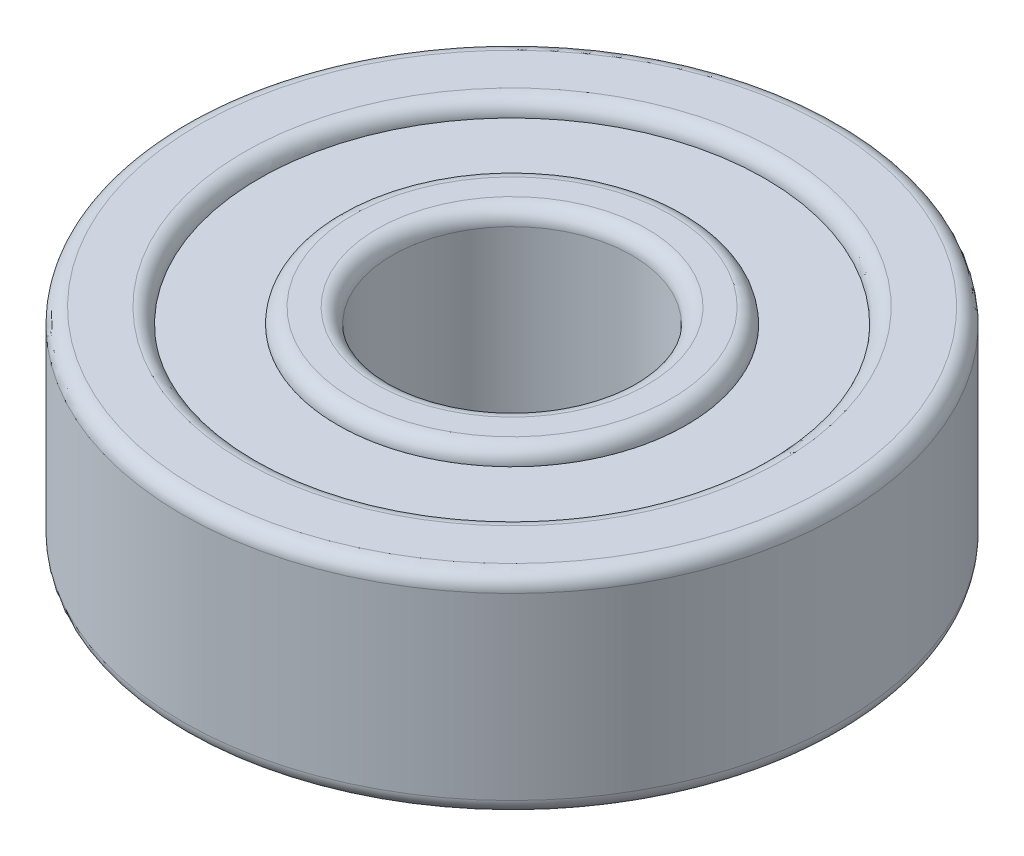
ISO-10303-21;
HEADER;
FILE_DESCRIPTION(('STEP AP214'),'2;1');
FILE_NAME('part.step','',(''),(''),'','','');
FILE_SCHEMA(('AUTOMOTIVE_DESIGN { 1 0 10303 214 1 1 1 1 }'));
ENDSEC;
DATA;
#1=APPLICATION_CONTEXT('core data for automotive mechanical design processes');
#2=APPLICATION_PROTOCOL_DEFINITION('international standard','automotive_design',2000,#1);
#3=PRODUCT_CONTEXT('',#1,'mechanical');
#4=PRODUCT('Part','Part','',(#3));
#5=PRODUCT_RELATED_PRODUCT_CATEGORY('part','',(#4));
#6=PRODUCT_DEFINITION_FORMATION('','',#4);
#7=PRODUCT_DEFINITION_CONTEXT('part definition',#1,'design');
#8=PRODUCT_DEFINITION('design','',#6,#7);
#9=PRODUCT_DEFINITION_SHAPE('','',#8);
#10=(LENGTH_UNIT() NAMED_UNIT(*) SI_UNIT(.MILLI.,.METRE.));
#11=(NAMED_UNIT(*) PLANE_ANGLE_UNIT() SI_UNIT($,.RADIAN.));
#12=(NAMED_UNIT(*) SI_UNIT($,.STERADIAN.) SOLID_ANGLE_UNIT());
#13=UNCERTAINTY_MEASURE_WITH_UNIT(LENGTH_MEASURE(1.E-05),#10,'distance_accuracy_value','');
#14=(GEOMETRIC_REPRESENTATION_CONTEXT(3) GLOBAL_UNCERTAINTY_ASSIGNED_CONTEXT((#13)) GLOBAL_UNIT_ASSIGNED_CONTEXT((#10,
#11,#12)) REPRESENTATION_CONTEXT('',''));
#15=CARTESIAN_POINT('',(0.,0.,0.));
#16=DIRECTION('',(0.,0.,1.));
#17=DIRECTION('',(1.,0.,0.));
#18=AXIS2_PLACEMENT_3D('',#15,#16,#17);
#19=CARTESIAN_POINT('',(0.,-26.8639331784423,0.));
#20=DIRECTION('',(0.,1.,0.));
#21=DIRECTION('',(0.,0.,-1.));
#22=AXIS2_PLACEMENT_3D('',#19,#20,#21);
#23=CYLINDRICAL_SURFACE('',#22,8.4400009);
#24=CARTESIAN_POINT('',(0.,-2.9920057,0.));
#25=DIRECTION('',(0.,-1.,0.));
#26=DIRECTION('',(0.,0.,-1.));
#27=AXIS2_PLACEMENT_3D('',#24,#25,#26);
#28=CIRCLE('',#27,8.4400009);
#29=CARTESIAN_POINT('',(0.,-2.9920057,-8.4400009));
#30=VERTEX_POINT('',#29);
#31=EDGE_CURVE('E51',#30,#30,#28,.F.);
#32=ORIENTED_EDGE('',*,*,#31,.T.);
#33=EDGE_LOOP('',(#32));
#34=FACE_BOUND('',#33,.T.);
#35=CARTESIAN_POINT('',(0.,-2.01495041180427,0.));
#36=DIRECTION('',(0.,-1.,0.));
#37=DIRECTION('',(0.,0.,-1.));
#38=AXIS2_PLACEMENT_3D('',#35,#36,#37);
#39=CIRCLE('',#38,8.4400009);
#40=CARTESIAN_POINT('',(0.,-2.01495041180427,-8.4400009));
#41=VERTEX_POINT('',#40);
#42=EDGE_CURVE('E55',#41,#41,#39,.T.);
#43=ORIENTED_EDGE('',*,*,#42,.T.);
#44=EDGE_LOOP('',(#43));
#45=FACE_BOUND('',#44,.T.);
#46=ADVANCED_FACE('F45',(#34,#45),#23,.T.);
#47=CARTESIAN_POINT('',(0.,-2.01495041180427,0.));
#48=DIRECTION('',(0.,1.,0.));
#49=DIRECTION('',(0.,0.,-1.));
#50=AXIS2_PLACEMENT_3D('',#47,#48,#49);
#51=PLANE('',#50);
#52=CARTESIAN_POINT('',(0.,-2.01495041180427,0.));
#53=DIRECTION('',(0.,-1.,0.));
#54=DIRECTION('',(0.,0.,-1.));
#55=AXIS2_PLACEMENT_3D('',#52,#53,#54);
#56=CIRCLE('',#55,5.8200036);
#57=CARTESIAN_POINT('',(0.,-2.01495041180427,-5.8200036));
#58=VERTEX_POINT('',#57);
#59=EDGE_CURVE('E60',#58,#58,#56,.T.);
#60=ORIENTED_EDGE('',*,*,#59,.T.);
#61=EDGE_LOOP('',(#60));
#62=FACE_BOUND('',#61,.T.);
#63=ORIENTED_EDGE('',*,*,#42,.F.);
#64=EDGE_LOOP('',(#63));
#65=FACE_BOUND('',#64,.T.);
#66=ADVANCED_FACE('F65',(#62,#65),#51,.T.);
#67=CARTESIAN_POINT('',(0.,-26.8639331784423,0.));
#68=DIRECTION('',(0.,1.,0.));
#69=DIRECTION('',(0.,0.,-1.));
#70=AXIS2_PLACEMENT_3D('',#67,#68,#69);
#71=CYLINDRICAL_SURFACE('',#70,5.8200036);
#72=CARTESIAN_POINT('',(0.,-2.9920057,0.));
#73=DIRECTION('',(0.,-1.,0.));
#74=DIRECTION('',(0.,0.,-1.));
#75=AXIS2_PLACEMENT_3D('',#72,#73,#74);
#76=CIRCLE('',#75,5.8200036);
#77=CARTESIAN_POINT('',(0.,-2.9920057,-5.8200036));
#78=VERTEX_POINT('',#77);
#79=EDGE_CURVE('E11',#78,#78,#76,.F.);
#80=ORIENTED_EDGE('',*,*,#79,.F.);
#81=EDGE_LOOP('',(#80));
#82=FACE_BOUND('',#81,.T.);
#83=ORIENTED_EDGE('',*,*,#59,.F.);
#84=EDGE_LOOP('',(#83));
#85=FACE_BOUND('',#84,.T.);
#86=ADVANCED_FACE('F68',(#82,#85),#71,.F.);
#87=CARTESIAN_POINT('',(0.,-2.9920057,0.));
#88=DIRECTION('',(0.,1.,0.));
#89=DIRECTION('',(0.,0.,-1.));
#90=AXIS2_PLACEMENT_3D('',#87,#88,#89);
#91=PLANE('',#90);
#92=ORIENTED_EDGE('',*,*,#31,.F.);
#93=EDGE_LOOP('',(#92));
#94=FACE_BOUND('',#93,.T.);
#95=ORIENTED_EDGE('',*,*,#79,.T.);
#96=EDGE_LOOP('',(#95));
#97=FACE_BOUND('',#96,.T.);
#98=ADVANCED_FACE('F70',(#94,#97),#91,.F.);
#99=CLOSED_SHELL('',(#46,#66,#86,#98));
#100=MANIFOLD_SOLID_BREP('B2',#99);
#101=CARTESIAN_POINT('',(0.,26.8639331784423,0.));
#102=DIRECTION('',(0.,-1.,0.));
#103=DIRECTION('',(0.,0.,-1.));
#104=AXIS2_PLACEMENT_3D('',#101,#102,#103);
#105=CYLINDRICAL_SURFACE('',#104,8.4400009);
#106=CARTESIAN_POINT('',(0.,2.9920057,0.));
#107=DIRECTION('',(0.,-1.,0.));
#108=DIRECTION('',(0.,0.,-1.));
#109=AXIS2_PLACEMENT_3D('',#106,#107,#108);
#110=CIRCLE('',#109,8.4400009);
#111=CARTESIAN_POINT('',(0.,2.9920057,-8.4400009));
#112=VERTEX_POINT('',#111);
#113=EDGE_CURVE('E140',#112,#112,#110,.F.);
#114=ORIENTED_EDGE('',*,*,#113,.F.);
#115=EDGE_LOOP('',(#114));
#116=FACE_BOUND('',#115,.T.);
#117=CARTESIAN_POINT('',(0.,2.01495041180427,0.));
#118=DIRECTION('',(0.,-1.,0.));
#119=DIRECTION('',(0.,0.,-1.));
#120=AXIS2_PLACEMENT_3D('',#117,#118,#119);
#121=CIRCLE('',#120,8.4400009);
#122=CARTESIAN_POINT('',(0.,2.01495041180427,-8.4400009));
#123=VERTEX_POINT('',#122);
#124=EDGE_CURVE('E144',#123,#123,#121,.T.);
#125=ORIENTED_EDGE('',*,*,#124,.F.);
#126=EDGE_LOOP('',(#125));
#127=FACE_BOUND('',#126,.T.);
#128=ADVANCED_FACE('F134',(#116,#127),#105,.T.);
#129=CARTESIAN_POINT('',(0.,2.01495041180427,0.));
#130=DIRECTION('',(0.,-1.,0.));
#131=DIRECTION('',(0.,0.,-1.));
#132=AXIS2_PLACEMENT_3D('',#129,#130,#131);
#133=PLANE('',#132);
#134=CARTESIAN_POINT('',(0.,2.01495041180427,0.));
#135=DIRECTION('',(0.,-1.,0.));
#136=DIRECTION('',(0.,0.,-1.));
#137=AXIS2_PLACEMENT_3D('',#134,#135,#136);
#138=CIRCLE('',#137,5.8200036);
#139=CARTESIAN_POINT('',(0.,2.01495041180427,-5.8200036));
#140=VERTEX_POINT('',#139);
#141=EDGE_CURVE('E149',#140,#140,#138,.T.);
#142=ORIENTED_EDGE('',*,*,#141,.F.);
#143=EDGE_LOOP('',(#142));
#144=FACE_BOUND('',#143,.T.);
#145=ORIENTED_EDGE('',*,*,#124,.T.);
#146=EDGE_LOOP('',(#145));
#147=FACE_BOUND('',#146,.T.);
#148=ADVANCED_FACE('F156',(#144,#147),#133,.T.);
#149=CARTESIAN_POINT('',(0.,26.8639331784423,0.));
#150=DIRECTION('',(0.,-1.,0.));
#151=DIRECTION('',(0.,0.,-1.));
#152=AXIS2_PLACEMENT_3D('',#149,#150,#151);
#153=CYLINDRICAL_SURFACE('',#152,5.8200036);
#154=CARTESIAN_POINT('',(0.,2.9920057,0.));
#155=DIRECTION('',(0.,-1.,0.));
#156=DIRECTION('',(0.,0.,-1.));
#157=AXIS2_PLACEMENT_3D('',#154,#155,#156);
#158=CIRCLE('',#157,5.8200036);
#159=CARTESIAN_POINT('',(0.,2.9920057,-5.8200036));
#160=VERTEX_POINT('',#159);
#161=EDGE_CURVE('E44',#160,#160,#158,.F.);
#162=ORIENTED_EDGE('',*,*,#161,.T.);
#163=EDGE_LOOP('',(#162));
#164=FACE_BOUND('',#163,.T.);
#165=ORIENTED_EDGE('',*,*,#141,.T.);
#166=EDGE_LOOP('',(#165));
#167=FACE_BOUND('',#166,.T.);
#168=ADVANCED_FACE('F154',(#164,#167),#153,.F.);
#169=CARTESIAN_POINT('',(0.,2.9920057,0.));
#170=DIRECTION('',(0.,-1.,0.));
#171=DIRECTION('',(0.,0.,-1.));
#172=AXIS2_PLACEMENT_3D('',#169,#170,#171);
#173=PLANE('',#172);
#174=ORIENTED_EDGE('',*,*,#113,.T.);
#175=EDGE_LOOP('',(#174));
#176=FACE_BOUND('',#175,.T.);
#177=ORIENTED_EDGE('',*,*,#161,.F.);
#178=EDGE_LOOP('',(#177));
#179=FACE_BOUND('',#178,.T.);
#180=ADVANCED_FACE('F175',(#176,#179),#173,.F.);
#181=CLOSED_SHELL('',(#128,#148,#168,#180));
#182=MANIFOLD_SOLID_BREP('B6',#181);
#183=CARTESIAN_POINT('',(5.68391542482456,0.,-4.53277129595592));
#184=DIRECTION('',(0.,1.,0.));
#185=DIRECTION('',(0.781831482468022,0.,-0.623489801858743));
#186=AXIS2_PLACEMENT_3D('',#183,#184,#185);
#187=SPHERICAL_SURFACE('',#186,2.3300055);
#188=CARTESIAN_POINT('',(5.68391542482456,2.3300055,-4.53277129595592));
#189=VERTEX_POINT('',#188);
#190=VERTEX_LOOP('',#189);
#191=FACE_BOUND('',#190,.T.);
#192=ADVANCED_FACE('F201',(#191),#187,.T.);
#193=CLOSED_SHELL('',(#192));
#194=MANIFOLD_SOLID_BREP('B39',#193);
#195=CARTESIAN_POINT('',(7.08772660401141,0.,1.61772734562699));
#196=DIRECTION('',(0.,1.,0.));
#197=DIRECTION('',(0.974927912181826,0.,0.222520933956305));
#198=AXIS2_PLACEMENT_3D('',#195,#196,#197);
#199=SPHERICAL_SURFACE('',#198,2.3300055);
#200=CARTESIAN_POINT('',(7.08772660401141,2.3300055,1.61772734562699));
#201=VERTEX_POINT('',#200);
#202=VERTEX_LOOP('',#201);
#203=FACE_BOUND('',#202,.T.);
#204=ADVANCED_FACE('F219',(#203),#199,.T.);
#205=CLOSED_SHELL('',(#204));
#206=MANIFOLD_SOLID_BREP('B130',#205);
#207=CARTESIAN_POINT('',(3.15433508710332,0.,6.55004430032877));
#208=DIRECTION('',(0.,1.,0.));
#209=DIRECTION('',(0.433883739117565,0.,0.900968867902416));
#210=AXIS2_PLACEMENT_3D('',#207,#208,#209);
#211=SPHERICAL_SURFACE('',#210,2.3300055);
#212=CARTESIAN_POINT('',(3.15433508710332,2.3300055,6.55004430032877));
#213=VERTEX_POINT('',#212);
#214=VERTEX_LOOP('',#213);
#215=FACE_BOUND('',#214,.T.);
#216=ADVANCED_FACE('F237',(#215),#211,.T.);
#217=CLOSED_SHELL('',(#216));
#218=MANIFOLD_SOLID_BREP('B197',#217);
#219=CARTESIAN_POINT('',(-3.15433508710322,0.,6.55004430032881));
#220=DIRECTION('',(0.,1.,0.));
#221=DIRECTION('',(-0.433883739117553,0.,0.900968867902422));
#222=AXIS2_PLACEMENT_3D('',#219,#220,#221);
#223=SPHERICAL_SURFACE('',#222,2.3300055);
#224=CARTESIAN_POINT('',(-3.15433508710322,2.3300055,6.55004430032881));
#225=VERTEX_POINT('',#224);
#226=VERTEX_LOOP('',#225);
#227=FACE_BOUND('',#226,.T.);
#228=ADVANCED_FACE('F255',(#227),#223,.T.);
#229=CLOSED_SHELL('',(#228));
#230=MANIFOLD_SOLID_BREP('B215',#229);
#231=CARTESIAN_POINT('',(-7.08772660401139,0.,1.61772734562709));
#232=DIRECTION('',(0.,1.,0.));
#233=DIRECTION('',(-0.974927912181823,0.,0.222520933956318));
#234=AXIS2_PLACEMENT_3D('',#231,#232,#233);
#235=SPHERICAL_SURFACE('',#234,2.3300055);
#236=CARTESIAN_POINT('',(-7.08772660401139,2.3300055,1.61772734562709));
#237=VERTEX_POINT('',#236);
#238=VERTEX_LOOP('',#237);
#239=FACE_BOUND('',#238,.T.);
#240=ADVANCED_FACE('F273',(#239),#235,.T.);
#241=CLOSED_SHELL('',(#240));
#242=MANIFOLD_SOLID_BREP('B233',#241);
#243=CARTESIAN_POINT('',(-5.68391542482462,0.,-4.53277129595584));
#244=DIRECTION('',(0.,1.,0.));
#245=DIRECTION('',(-0.781831482468031,0.,-0.623489801858732));
#246=AXIS2_PLACEMENT_3D('',#243,#244,#245);
#247=SPHERICAL_SURFACE('',#246,2.3300055);
#248=CARTESIAN_POINT('',(-5.68391542482462,2.3300055,-4.53277129595584));
#249=VERTEX_POINT('',#248);
#250=VERTEX_LOOP('',#249);
#251=FACE_BOUND('',#250,.T.);
#252=ADVANCED_FACE('F291',(#251),#247,.T.);
#253=CLOSED_SHELL('',(#252));
#254=MANIFOLD_SOLID_BREP('B251',#253);
#255=CARTESIAN_POINT('',(0.,0.,-7.2700007));
#256=DIRECTION('',(0.,1.,0.));
#257=DIRECTION('',(0.,0.,-1.));
#258=AXIS2_PLACEMENT_3D('',#255,#256,#257);
#259=SPHERICAL_SURFACE('',#258,2.3300055);
#260=CARTESIAN_POINT('',(0.,2.3300055,-7.2700007));
#261=VERTEX_POINT('',#260);
#262=VERTEX_LOOP('',#261);
#263=FACE_BOUND('',#262,.T.);
#264=ADVANCED_FACE('F311',(#263),#259,.T.);
#265=CLOSED_SHELL('',(#264));
#266=MANIFOLD_SOLID_BREP('B269',#265);
#267=CARTESIAN_POINT('',(0.,-3.5000057,0.));
#268=DIRECTION('',(0.,1.,0.));
#269=DIRECTION('',(0.,0.,1.));
#270=AXIS2_PLACEMENT_3D('',#267,#268,#269);
#271=CYLINDRICAL_SURFACE('',#270,8.4400009);
#272=CARTESIAN_POINT('',(0.,2.9920057,0.));
#273=DIRECTION('',(0.,1.,0.));
#274=DIRECTION('',(0.,0.,1.));
#275=AXIS2_PLACEMENT_3D('',#272,#273,#274);
#276=CIRCLE('',#275,8.4400009);
#277=CARTESIAN_POINT('',(0.,2.9920057,8.4400009));
#278=VERTEX_POINT('',#277);
#279=EDGE_CURVE('E350',#278,#278,#276,.T.);
#280=ORIENTED_EDGE('',*,*,#279,.T.);
#281=EDGE_LOOP('',(#280));
#282=FACE_BOUND('',#281,.T.);
#283=CARTESIAN_POINT('',(0.,2.01495041180427,0.));
#284=DIRECTION('',(0.,-1.,0.));
#285=DIRECTION('',(0.,0.,-1.));
#286=AXIS2_PLACEMENT_3D('',#283,#284,#285);
#287=CIRCLE('',#286,8.4400009);
#288=CARTESIAN_POINT('',(0.,2.01495041180427,-8.4400009));
#289=VERTEX_POINT('',#288);
#290=EDGE_CURVE('E362',#289,#289,#287,.F.);
#291=ORIENTED_EDGE('',*,*,#290,.F.);
#292=EDGE_LOOP('',(#291));
#293=FACE_BOUND('',#292,.T.);
#294=ADVANCED_FACE('F330',(#282,#293),#271,.F.);
#295=CARTESIAN_POINT('',(0.,-2.9920057,0.));
#296=DIRECTION('',(0.,1.,0.));
#297=DIRECTION('',(0.,0.,1.));
#298=AXIS2_PLACEMENT_3D('',#295,#296,#297);
#299=CIRCLE('',#298,8.4400009);
#300=CARTESIAN_POINT('',(0.,-2.9920057,8.4400009));
#301=VERTEX_POINT('',#300);
#302=EDGE_CURVE('E353',#301,#301,#299,.F.);
#303=ORIENTED_EDGE('',*,*,#302,.T.);
#304=EDGE_LOOP('',(#303));
#305=FACE_BOUND('',#304,.T.);
#306=CARTESIAN_POINT('',(0.,-2.01495041180427,0.));
#307=DIRECTION('',(0.,1.,0.));
#308=DIRECTION('',(0.,0.,1.));
#309=AXIS2_PLACEMENT_3D('',#306,#307,#308);
#310=CIRCLE('',#309,8.4400009);
#311=CARTESIAN_POINT('',(0.,-2.01495041180427,8.4400009));
#312=VERTEX_POINT('',#311);
#313=EDGE_CURVE('E365',#312,#312,#310,.F.);
#314=ORIENTED_EDGE('',*,*,#313,.F.);
#315=EDGE_LOOP('',(#314));
#316=FACE_BOUND('',#315,.T.);
#317=ADVANCED_FACE('F372',(#305,#316),#271,.F.);
#318=CARTESIAN_POINT('',(0.,3.5000057,0.));
#319=DIRECTION('',(0.,1.,0.));
#320=DIRECTION('',(0.,0.,1.));
#321=AXIS2_PLACEMENT_3D('',#318,#319,#320);
#322=PLANE('',#321);
#323=CARTESIAN_POINT('',(0.,3.5000057,0.));
#324=DIRECTION('',(0.,1.,0.));
#325=DIRECTION('',(0.,0.,1.));
#326=AXIS2_PLACEMENT_3D('',#323,#324,#325);
#327=CIRCLE('',#326,8.9480009);
#328=CARTESIAN_POINT('',(0.,3.5000057,8.9480009));
#329=VERTEX_POINT('',#328);
#330=EDGE_CURVE('E341',#329,#329,#327,.F.);
#331=ORIENTED_EDGE('',*,*,#330,.T.);
#332=EDGE_LOOP('',(#331));
#333=FACE_BOUND('',#332,.T.);
#334=CARTESIAN_POINT('',(0.,3.5000057,0.));
#335=DIRECTION('',(0.,1.,0.));
#336=DIRECTION('',(0.,0.,1.));
#337=AXIS2_PLACEMENT_3D('',#334,#335,#336);
#338=CIRCLE('',#337,10.4920034);
#339=CARTESIAN_POINT('',(0.,3.5000057,10.4920034));
#340=VERTEX_POINT('',#339);
#341=EDGE_CURVE('E345',#340,#340,#338,.T.);
#342=ORIENTED_EDGE('',*,*,#341,.T.);
#343=EDGE_LOOP('',(#342));
#344=FACE_BOUND('',#343,.T.);
#345=ADVANCED_FACE('F374',(#333,#344),#322,.T.);
#346=CARTESIAN_POINT('',(0.,-3.5000057,0.));
#347=DIRECTION('',(0.,1.,0.));
#348=DIRECTION('',(0.,0.,1.));
#349=AXIS2_PLACEMENT_3D('',#346,#347,#348);
#350=PLANE('',#349);
#351=CARTESIAN_POINT('',(0.,-3.5000057,0.));
#352=DIRECTION('',(0.,1.,0.));
#353=DIRECTION('',(0.,0.,1.));
#354=AXIS2_PLACEMENT_3D('',#351,#352,#353);
#355=CIRCLE('',#354,8.9480009);
#356=CARTESIAN_POINT('',(0.,-3.5000057,8.9480009));
#357=VERTEX_POINT('',#356);
#358=EDGE_CURVE('E356',#357,#357,#355,.T.);
#359=ORIENTED_EDGE('',*,*,#358,.T.);
#360=EDGE_LOOP('',(#359));
#361=FACE_BOUND('',#360,.T.);
#362=CARTESIAN_POINT('',(0.,-3.5000057,0.));
#363=DIRECTION('',(0.,1.,0.));
#364=DIRECTION('',(0.,0.,1.));
#365=AXIS2_PLACEMENT_3D('',#362,#363,#364);
#366=CIRCLE('',#365,10.4920034);
#367=CARTESIAN_POINT('',(0.,-3.5000057,10.4920034));
#368=VERTEX_POINT('',#367);
#369=EDGE_CURVE('E359',#368,#368,#366,.F.);
#370=ORIENTED_EDGE('',*,*,#369,.T.);
#371=EDGE_LOOP('',(#370));
#372=FACE_BOUND('',#371,.T.);
#373=ADVANCED_FACE('F381',(#361,#372),#350,.F.);
#374=CARTESIAN_POINT('',(0.,3.5000057,0.));
#375=DIRECTION('',(0.,-1.,0.));
#376=DIRECTION('',(0.,0.,-1.));
#377=AXIS2_PLACEMENT_3D('',#374,#375,#376);
#378=CYLINDRICAL_SURFACE('',#377,11.0000034);
#379=CARTESIAN_POINT('',(0.,-2.9920057,0.));
#380=DIRECTION('',(0.,1.,0.));
#381=DIRECTION('',(0.,0.,1.));
#382=AXIS2_PLACEMENT_3D('',#379,#380,#381);
#383=CIRCLE('',#382,11.0000034);
#384=CARTESIAN_POINT('',(0.,-2.9920057,11.0000034));
#385=VERTEX_POINT('',#384);
#386=EDGE_CURVE('E310',#385,#385,#383,.T.);
#387=ORIENTED_EDGE('',*,*,#386,.T.);
#388=EDGE_LOOP('',(#387));
#389=FACE_BOUND('',#388,.T.);
#390=CARTESIAN_POINT('',(0.,2.9920057,0.));
#391=DIRECTION('',(0.,1.,0.));
#392=DIRECTION('',(0.,0.,1.));
#393=AXIS2_PLACEMENT_3D('',#390,#391,#392);
#394=CIRCLE('',#393,11.0000034);
#395=CARTESIAN_POINT('',(0.,2.9920057,11.0000034));
#396=VERTEX_POINT('',#395);
#397=EDGE_CURVE('E337',#396,#396,#394,.F.);
#398=ORIENTED_EDGE('',*,*,#397,.T.);
#399=EDGE_LOOP('',(#398));
#400=FACE_BOUND('',#399,.T.);
#401=ADVANCED_FACE('F386',(#389,#400),#378,.T.);
#402=CARTESIAN_POINT('',(0.,0.,0.));
#403=DIRECTION('',(0.,1.,0.));
#404=DIRECTION('',(0.,0.,1.));
#405=AXIS2_PLACEMENT_3D('',#402,#403,#404);
#406=TOROIDAL_SURFACE('',#405,7.2700007,2.3300055);
#407=ORIENTED_EDGE('',*,*,#313,.T.);
#408=EDGE_LOOP('',(#407));
#409=FACE_BOUND('',#408,.T.);
#410=ORIENTED_EDGE('',*,*,#290,.T.);
#411=EDGE_LOOP('',(#410));
#412=FACE_BOUND('',#411,.T.);
#413=ADVANCED_FACE('F369',(#409,#412),#406,.F.);
#414=CARTESIAN_POINT('',(0.,-2.9920057,0.));
#415=DIRECTION('',(0.,1.,0.));
#416=DIRECTION('',(0.,0.,1.));
#417=AXIS2_PLACEMENT_3D('',#414,#415,#416);
#418=TOROIDAL_SURFACE('',#417,8.9480009,0.508);
#419=ORIENTED_EDGE('',*,*,#302,.F.);
#420=EDGE_LOOP('',(#419));
#421=FACE_BOUND('',#420,.T.);
#422=ORIENTED_EDGE('',*,*,#358,.F.);
#423=EDGE_LOOP('',(#422));
#424=FACE_BOUND('',#423,.T.);
#425=ADVANCED_FACE('F392',(#421,#424),#418,.T.);
#426=CARTESIAN_POINT('',(0.,2.9920057,0.));
#427=DIRECTION('',(0.,1.,0.));
#428=DIRECTION('',(0.,0.,1.));
#429=AXIS2_PLACEMENT_3D('',#426,#427,#428);
#430=TOROIDAL_SURFACE('',#429,8.9480009,0.508);
#431=ORIENTED_EDGE('',*,*,#330,.F.);
#432=EDGE_LOOP('',(#431));
#433=FACE_BOUND('',#432,.T.);
#434=ORIENTED_EDGE('',*,*,#279,.F.);
#435=EDGE_LOOP('',(#434));
#436=FACE_BOUND('',#435,.T.);
#437=ADVANCED_FACE('F395',(#433,#436),#430,.T.);
#438=CARTESIAN_POINT('',(0.,-2.9920057,0.));
#439=DIRECTION('',(0.,1.,0.));
#440=DIRECTION('',(0.,0.,1.));
#441=AXIS2_PLACEMENT_3D('',#438,#439,#440);
#442=TOROIDAL_SURFACE('',#441,10.4920034,0.508);
#443=ORIENTED_EDGE('',*,*,#369,.F.);
#444=EDGE_LOOP('',(#443));
#445=FACE_BOUND('',#444,.T.);
#446=ORIENTED_EDGE('',*,*,#386,.F.);
#447=EDGE_LOOP('',(#446));
#448=FACE_BOUND('',#447,.T.);
#449=ADVANCED_FACE('F398',(#445,#448),#442,.T.);
#450=CARTESIAN_POINT('',(0.,2.9920057,0.));
#451=DIRECTION('',(0.,1.,0.));
#452=DIRECTION('',(0.,0.,1.));
#453=AXIS2_PLACEMENT_3D('',#450,#451,#452);
#454=TOROIDAL_SURFACE('',#453,10.4920034,0.508);
#455=ORIENTED_EDGE('',*,*,#397,.F.);
#456=EDGE_LOOP('',(#455));
#457=FACE_BOUND('',#456,.T.);
#458=ORIENTED_EDGE('',*,*,#341,.F.);
#459=EDGE_LOOP('',(#458));
#460=FACE_BOUND('',#459,.T.);
#461=ADVANCED_FACE('F332',(#457,#460),#454,.T.);
#462=CLOSED_SHELL('',(#294,#317,#345,#373,#401,#413,#425,#437,#449,#461));
#463=MANIFOLD_SOLID_BREP('B287',#462);
#464=CARTESIAN_POINT('',(0.,-3.5000057,0.));
#465=DIRECTION('',(0.,1.,0.));
#466=DIRECTION('',(0.,0.,1.));
#467=AXIS2_PLACEMENT_3D('',#464,#465,#466);
#468=CYLINDRICAL_SURFACE('',#467,5.8200036);
#469=CARTESIAN_POINT('',(0.,2.9920057,0.));
#470=DIRECTION('',(0.,1.,0.));
#471=DIRECTION('',(0.,0.,1.));
#472=AXIS2_PLACEMENT_3D('',#469,#470,#471);
#473=CIRCLE('',#472,5.8200036);
#474=CARTESIAN_POINT('',(0.,2.9920057,5.8200036));
#475=VERTEX_POINT('',#474);
#476=EDGE_CURVE('E329',#475,#475,#473,.F.);
#477=ORIENTED_EDGE('',*,*,#476,.T.);
#478=EDGE_LOOP('',(#477));
#479=FACE_BOUND('',#478,.T.);
#480=CARTESIAN_POINT('',(0.,1.8238514303588,0.));
#481=DIRECTION('',(0.,-1.,0.));
#482=DIRECTION('',(0.,0.,-1.));
#483=AXIS2_PLACEMENT_3D('',#480,#481,#482);
#484=CIRCLE('',#483,5.8200036);
#485=CARTESIAN_POINT('',(0.,1.8238514303588,-5.8200036));
#486=VERTEX_POINT('',#485);
#487=EDGE_CURVE('E512',#486,#486,#484,.F.);
#488=ORIENTED_EDGE('',*,*,#487,.T.);
#489=EDGE_LOOP('',(#488));
#490=FACE_BOUND('',#489,.T.);
#491=ADVANCED_FACE('F480',(#479,#490),#468,.T.);
#492=CARTESIAN_POINT('',(0.,-2.9920057,0.));
#493=DIRECTION('',(0.,1.,0.));
#494=DIRECTION('',(0.,0.,1.));
#495=AXIS2_PLACEMENT_3D('',#492,#493,#494);
#496=CIRCLE('',#495,5.8200036);
#497=CARTESIAN_POINT('',(0.,-2.9920057,5.8200036));
#498=VERTEX_POINT('',#497);
#499=EDGE_CURVE('E495',#498,#498,#496,.T.);
#500=ORIENTED_EDGE('',*,*,#499,.T.);
#501=EDGE_LOOP('',(#500));
#502=FACE_BOUND('',#501,.T.);
#503=CARTESIAN_POINT('',(0.,-1.8238514303588,0.));
#504=DIRECTION('',(0.,1.,0.));
#505=DIRECTION('',(0.,0.,1.));
#506=AXIS2_PLACEMENT_3D('',#503,#504,#505);
#507=CIRCLE('',#506,5.8200036);
#508=CARTESIAN_POINT('',(0.,-1.8238514303588,5.8200036));
#509=VERTEX_POINT('',#508);
#510=EDGE_CURVE('E515',#509,#509,#507,.F.);
#511=ORIENTED_EDGE('',*,*,#510,.T.);
#512=EDGE_LOOP('',(#511));
#513=FACE_BOUND('',#512,.T.);
#514=ADVANCED_FACE('F519',(#502,#513),#468,.T.);
#515=CARTESIAN_POINT('',(0.,3.5000057,0.));
#516=DIRECTION('',(0.,1.,0.));
#517=DIRECTION('',(0.,0.,1.));
#518=AXIS2_PLACEMENT_3D('',#515,#516,#517);
#519=PLANE('',#518);
#520=CARTESIAN_POINT('',(0.,3.5000057,0.));
#521=DIRECTION('',(0.,1.,0.));
#522=DIRECTION('',(0.,0.,1.));
#523=AXIS2_PLACEMENT_3D('',#520,#521,#522);
#524=CIRCLE('',#523,4.5080047);
#525=CARTESIAN_POINT('',(0.,3.5000057,4.5080047));
#526=VERTEX_POINT('',#525);
#527=EDGE_CURVE('E487',#526,#526,#524,.F.);
#528=ORIENTED_EDGE('',*,*,#527,.T.);
#529=EDGE_LOOP('',(#528));
#530=FACE_BOUND('',#529,.T.);
#531=CARTESIAN_POINT('',(0.,3.5000057,0.));
#532=DIRECTION('',(0.,1.,0.));
#533=DIRECTION('',(0.,0.,1.));
#534=AXIS2_PLACEMENT_3D('',#531,#532,#533);
#535=CIRCLE('',#534,5.3120036);
#536=CARTESIAN_POINT('',(0.,3.5000057,5.3120036));
#537=VERTEX_POINT('',#536);
#538=EDGE_CURVE('E491',#537,#537,#535,.T.);
#539=ORIENTED_EDGE('',*,*,#538,.T.);
#540=EDGE_LOOP('',(#539));
#541=FACE_BOUND('',#540,.T.);
#542=ADVANCED_FACE('F543',(#530,#541),#519,.T.);
#543=CARTESIAN_POINT('',(0.,3.5000057,0.));
#544=DIRECTION('',(0.,-1.,0.));
#545=DIRECTION('',(0.,0.,-1.));
#546=AXIS2_PLACEMENT_3D('',#543,#544,#545);
#547=CYLINDRICAL_SURFACE('',#546,4.0000047);
#548=CARTESIAN_POINT('',(0.,-2.9920057,0.));
#549=DIRECTION('',(0.,1.,0.));
#550=DIRECTION('',(0.,0.,1.));
#551=AXIS2_PLACEMENT_3D('',#548,#549,#550);
#552=CIRCLE('',#551,4.0000047);
#553=CARTESIAN_POINT('',(0.,-2.9920057,4.0000047));
#554=VERTEX_POINT('',#553);
#555=EDGE_CURVE('E500',#554,#554,#552,.F.);
#556=ORIENTED_EDGE('',*,*,#555,.T.);
#557=EDGE_LOOP('',(#556));
#558=FACE_BOUND('',#557,.T.);
#559=CARTESIAN_POINT('',(0.,2.9920057,0.));
#560=DIRECTION('',(0.,1.,0.));
#561=DIRECTION('',(0.,0.,1.));
#562=AXIS2_PLACEMENT_3D('',#559,#560,#561);
#563=CIRCLE('',#562,4.0000047);
#564=CARTESIAN_POINT('',(0.,2.9920057,4.0000047));
#565=VERTEX_POINT('',#564);
#566=EDGE_CURVE('E503',#565,#565,#563,.T.);
#567=ORIENTED_EDGE('',*,*,#566,.T.);
#568=EDGE_LOOP('',(#567));
#569=FACE_BOUND('',#568,.T.);
#570=ADVANCED_FACE('F534',(#558,#569),#547,.F.);
#571=CARTESIAN_POINT('',(0.,-3.5000057,0.));
#572=DIRECTION('',(0.,1.,0.));
#573=DIRECTION('',(0.,0.,1.));
#574=AXIS2_PLACEMENT_3D('',#571,#572,#573);
#575=PLANE('',#574);
#576=CARTESIAN_POINT('',(0.,-3.5000057,0.));
#577=DIRECTION('',(0.,1.,0.));
#578=DIRECTION('',(0.,0.,1.));
#579=AXIS2_PLACEMENT_3D('',#576,#577,#578);
#580=CIRCLE('',#579,4.5080047);
#581=CARTESIAN_POINT('',(0.,-3.5000057,4.5080047));
#582=VERTEX_POINT('',#581);
#583=EDGE_CURVE('E506',#582,#582,#580,.T.);
#584=ORIENTED_EDGE('',*,*,#583,.T.);
#585=EDGE_LOOP('',(#584));
#586=FACE_BOUND('',#585,.T.);
#587=CARTESIAN_POINT('',(0.,-3.5000057,0.));
#588=DIRECTION('',(0.,1.,0.));
#589=DIRECTION('',(0.,0.,1.));
#590=AXIS2_PLACEMENT_3D('',#587,#588,#589);
#591=CIRCLE('',#590,5.3120036);
#592=CARTESIAN_POINT('',(0.,-3.5000057,5.3120036));
#593=VERTEX_POINT('',#592);
#594=EDGE_CURVE('E509',#593,#593,#591,.F.);
#595=ORIENTED_EDGE('',*,*,#594,.T.);
#596=EDGE_LOOP('',(#595));
#597=FACE_BOUND('',#596,.T.);
#598=ADVANCED_FACE('F524',(#586,#597),#575,.F.);
#599=CARTESIAN_POINT('',(0.,0.,0.));
#600=DIRECTION('',(0.,1.,0.));
#601=DIRECTION('',(0.,0.,1.));
#602=AXIS2_PLACEMENT_3D('',#599,#600,#601);
#603=TOROIDAL_SURFACE('',#602,7.2700007,2.3300055);
#604=ORIENTED_EDGE('',*,*,#487,.F.);
#605=EDGE_LOOP('',(#604));
#606=FACE_BOUND('',#605,.T.);
#607=ORIENTED_EDGE('',*,*,#510,.F.);
#608=EDGE_LOOP('',(#607));
#609=FACE_BOUND('',#608,.T.);
#610=ADVANCED_FACE('F521',(#606,#609),#603,.F.);
#611=CARTESIAN_POINT('',(0.,-2.9920057,0.));
#612=DIRECTION('',(0.,1.,0.));
#613=DIRECTION('',(0.,0.,1.));
#614=AXIS2_PLACEMENT_3D('',#611,#612,#613);
#615=TOROIDAL_SURFACE('',#614,4.5080047,0.508);
#616=ORIENTED_EDGE('',*,*,#555,.F.);
#617=EDGE_LOOP('',(#616));
#618=FACE_BOUND('',#617,.T.);
#619=ORIENTED_EDGE('',*,*,#583,.F.);
#620=EDGE_LOOP('',(#619));
#621=FACE_BOUND('',#620,.T.);
#622=ADVANCED_FACE('F523',(#618,#621),#615,.T.);
#623=CARTESIAN_POINT('',(0.,-2.9920057,0.));
#624=DIRECTION('',(0.,1.,0.));
#625=DIRECTION('',(0.,0.,1.));
#626=AXIS2_PLACEMENT_3D('',#623,#624,#625);
#627=TOROIDAL_SURFACE('',#626,5.3120036,0.508);
#628=ORIENTED_EDGE('',*,*,#594,.F.);
#629=EDGE_LOOP('',(#628));
#630=FACE_BOUND('',#629,.T.);
#631=ORIENTED_EDGE('',*,*,#499,.F.);
#632=EDGE_LOOP('',(#631));
#633=FACE_BOUND('',#632,.T.);
#634=ADVANCED_FACE('F531',(#630,#633),#627,.T.);
#635=CARTESIAN_POINT('',(0.,2.9920057,0.));
#636=DIRECTION('',(0.,1.,0.));
#637=DIRECTION('',(0.,0.,1.));
#638=AXIS2_PLACEMENT_3D('',#635,#636,#637);
#639=TOROIDAL_SURFACE('',#638,4.5080047,0.508);
#640=ORIENTED_EDGE('',*,*,#527,.F.);
#641=EDGE_LOOP('',(#640));
#642=FACE_BOUND('',#641,.T.);
#643=ORIENTED_EDGE('',*,*,#566,.F.);
#644=EDGE_LOOP('',(#643));
#645=FACE_BOUND('',#644,.T.);
#646=ADVANCED_FACE('F553',(#642,#645),#639,.T.);
#647=CARTESIAN_POINT('',(0.,2.9920057,0.));
#648=DIRECTION('',(0.,1.,0.));
#649=DIRECTION('',(0.,0.,1.));
#650=AXIS2_PLACEMENT_3D('',#647,#648,#649);
#651=TOROIDAL_SURFACE('',#650,5.3120036,0.508);
#652=ORIENTED_EDGE('',*,*,#476,.F.);
#653=EDGE_LOOP('',(#652));
#654=FACE_BOUND('',#653,.T.);
#655=ORIENTED_EDGE('',*,*,#538,.F.);
#656=EDGE_LOOP('',(#655));
#657=FACE_BOUND('',#656,.T.);
#658=ADVANCED_FACE('F482',(#654,#657),#651,.T.);
#659=CLOSED_SHELL('',(#491,#514,#542,#570,#598,#610,#622,#634,#646,#658));
#660=MANIFOLD_SOLID_BREP('B305',#659);
#661=ADVANCED_BREP_SHAPE_REPRESENTATION('',(#18,#100,#182,#194,#206,#218,#230,#242,#254,#266,
#463,#660),#14);
#662=SHAPE_DEFINITION_REPRESENTATION(#9,#661);
ENDSEC;
END-ISO-10303-21;
